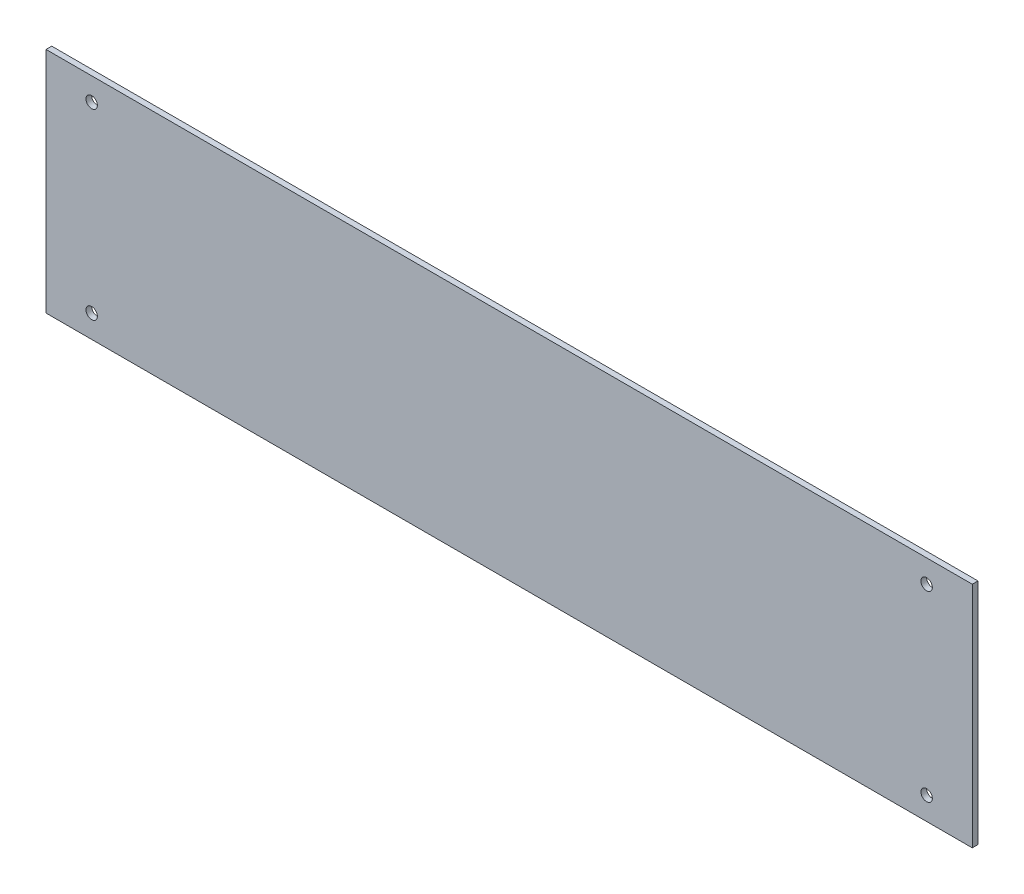
ISO-10303-21;
HEADER;
FILE_DESCRIPTION(('STEP AP214'),'2;1');
FILE_NAME('part.step','',(''),(''),'','','');
FILE_SCHEMA(('AUTOMOTIVE_DESIGN { 1 0 10303 214 1 1 1 1 }'));
ENDSEC;
DATA;
#1=APPLICATION_CONTEXT('core data for automotive mechanical design processes');
#2=APPLICATION_PROTOCOL_DEFINITION('international standard','automotive_design',2000,#1);
#3=PRODUCT_CONTEXT('',#1,'mechanical');
#4=PRODUCT('Part','Part','',(#3));
#5=PRODUCT_RELATED_PRODUCT_CATEGORY('part','',(#4));
#6=PRODUCT_DEFINITION_FORMATION('','',#4);
#7=PRODUCT_DEFINITION_CONTEXT('part definition',#1,'design');
#8=PRODUCT_DEFINITION('design','',#6,#7);
#9=PRODUCT_DEFINITION_SHAPE('','',#8);
#10=(LENGTH_UNIT() NAMED_UNIT(*) SI_UNIT(.MILLI.,.METRE.));
#11=(NAMED_UNIT(*) PLANE_ANGLE_UNIT() SI_UNIT($,.RADIAN.));
#12=(NAMED_UNIT(*) SI_UNIT($,.STERADIAN.) SOLID_ANGLE_UNIT());
#13=UNCERTAINTY_MEASURE_WITH_UNIT(LENGTH_MEASURE(1.E-05),#10,'distance_accuracy_value','');
#14=(GEOMETRIC_REPRESENTATION_CONTEXT(3) GLOBAL_UNCERTAINTY_ASSIGNED_CONTEXT((#13)) GLOBAL_UNIT_ASSIGNED_CONTEXT((#10,
#11,#12)) REPRESENTATION_CONTEXT('',''));
#15=CARTESIAN_POINT('',(0.,0.,0.));
#16=DIRECTION('',(0.,0.,1.));
#17=DIRECTION('',(1.,0.,0.));
#18=AXIS2_PLACEMENT_3D('',#15,#16,#17);
#19=CARTESIAN_POINT('',(0.,0.,3.175));
#20=DIRECTION('',(0.,0.,-1.));
#21=DIRECTION('',(-1.,0.,0.));
#22=AXIS2_PLACEMENT_3D('',#19,#20,#21);
#23=PLANE('',#22);
#24=DIRECTION('',(0.,1.,0.));
#25=VECTOR('',#24,1.);
#26=CARTESIAN_POINT('',(257.60299,-63.5,3.175));
#27=LINE('',#26,#25);
#28=CARTESIAN_POINT('',(257.60299,-63.5,3.175));
#29=VERTEX_POINT('',#28);
#30=CARTESIAN_POINT('',(257.60299,63.5,3.175));
#31=VERTEX_POINT('',#30);
#32=EDGE_CURVE('E92',#29,#31,#27,.T.);
#33=ORIENTED_EDGE('',*,*,#32,.T.);
#34=DIRECTION('',(-1.,0.,0.));
#35=VECTOR('',#34,1.);
#36=CARTESIAN_POINT('',(-257.60299,63.5,3.175));
#37=LINE('',#36,#35);
#38=CARTESIAN_POINT('',(-257.60299,63.5,3.175));
#39=VERTEX_POINT('',#38);
#40=EDGE_CURVE('E87',#31,#39,#37,.T.);
#41=ORIENTED_EDGE('',*,*,#40,.T.);
#42=DIRECTION('',(0.,-1.,0.));
#43=VECTOR('',#42,1.);
#44=CARTESIAN_POINT('',(-257.60299,-63.5,3.175));
#45=LINE('',#44,#43);
#46=CARTESIAN_POINT('',(-257.60299,-63.5,3.175));
#47=VERTEX_POINT('',#46);
#48=EDGE_CURVE('E90',#39,#47,#45,.T.);
#49=ORIENTED_EDGE('',*,*,#48,.T.);
#50=DIRECTION('',(1.,0.,0.));
#51=VECTOR('',#50,1.);
#52=CARTESIAN_POINT('',(-257.60299,-63.5,3.175));
#53=LINE('',#52,#51);
#54=EDGE_CURVE('E57',#47,#29,#53,.T.);
#55=ORIENTED_EDGE('',*,*,#54,.T.);
#56=EDGE_LOOP('',(#33,#41,#49,#55));
#57=FACE_BOUND('',#56,.T.);
#58=CARTESIAN_POINT('',(-232.20299,-50.8,3.175));
#59=DIRECTION('',(0.,0.,1.));
#60=DIRECTION('',(1.,0.,0.));
#61=AXIS2_PLACEMENT_3D('',#58,#59,#60);
#62=CIRCLE('',#61,3.175);
#63=CARTESIAN_POINT('',(-229.02799,-50.8,3.175));
#64=VERTEX_POINT('',#63);
#65=EDGE_CURVE('E112',#64,#64,#62,.T.);
#66=ORIENTED_EDGE('',*,*,#65,.F.);
#67=EDGE_LOOP('',(#66));
#68=FACE_BOUND('',#67,.T.);
#69=CARTESIAN_POINT('',(-232.20299,50.8,3.175));
#70=DIRECTION('',(0.,0.,1.));
#71=DIRECTION('',(1.,0.,0.));
#72=AXIS2_PLACEMENT_3D('',#69,#70,#71);
#73=CIRCLE('',#72,3.175);
#74=CARTESIAN_POINT('',(-229.02799,50.8,3.175));
#75=VERTEX_POINT('',#74);
#76=EDGE_CURVE('E134',#75,#75,#73,.T.);
#77=ORIENTED_EDGE('',*,*,#76,.F.);
#78=EDGE_LOOP('',(#77));
#79=FACE_BOUND('',#78,.T.);
#80=CARTESIAN_POINT('',(232.20299,-50.8,3.175));
#81=DIRECTION('',(0.,0.,1.));
#82=DIRECTION('',(1.,0.,0.));
#83=AXIS2_PLACEMENT_3D('',#80,#81,#82);
#84=CIRCLE('',#83,3.175);
#85=CARTESIAN_POINT('',(235.37799,-50.8,3.175));
#86=VERTEX_POINT('',#85);
#87=EDGE_CURVE('E142',#86,#86,#84,.T.);
#88=ORIENTED_EDGE('',*,*,#87,.F.);
#89=EDGE_LOOP('',(#88));
#90=FACE_BOUND('',#89,.T.);
#91=CARTESIAN_POINT('',(232.20299,50.8,3.175));
#92=DIRECTION('',(0.,0.,1.));
#93=DIRECTION('',(1.,0.,0.));
#94=AXIS2_PLACEMENT_3D('',#91,#92,#93);
#95=CIRCLE('',#94,3.175);
#96=CARTESIAN_POINT('',(235.37799,50.8,3.175));
#97=VERTEX_POINT('',#96);
#98=EDGE_CURVE('E150',#97,#97,#95,.T.);
#99=ORIENTED_EDGE('',*,*,#98,.F.);
#100=EDGE_LOOP('',(#99));
#101=FACE_BOUND('',#100,.T.);
#102=ADVANCED_FACE('F39',(#57,#68,#79,#90,#101),#23,.F.);
#103=CARTESIAN_POINT('',(0.,0.,0.));
#104=DIRECTION('',(0.,0.,-1.));
#105=DIRECTION('',(-1.,0.,0.));
#106=AXIS2_PLACEMENT_3D('',#103,#104,#105);
#107=PLANE('',#106);
#108=CARTESIAN_POINT('',(232.20299,-50.8,0.));
#109=DIRECTION('',(0.,0.,1.));
#110=DIRECTION('',(1.,0.,0.));
#111=AXIS2_PLACEMENT_3D('',#108,#109,#110);
#112=CIRCLE('',#111,3.175);
#113=CARTESIAN_POINT('',(235.37799,-50.8,0.));
#114=VERTEX_POINT('',#113);
#115=EDGE_CURVE('E146',#114,#114,#112,.T.);
#116=ORIENTED_EDGE('',*,*,#115,.T.);
#117=EDGE_LOOP('',(#116));
#118=FACE_BOUND('',#117,.T.);
#119=CARTESIAN_POINT('',(-232.20299,-50.8,0.));
#120=DIRECTION('',(0.,0.,1.));
#121=DIRECTION('',(1.,0.,0.));
#122=AXIS2_PLACEMENT_3D('',#119,#120,#121);
#123=CIRCLE('',#122,3.175);
#124=CARTESIAN_POINT('',(-229.02799,-50.8,0.));
#125=VERTEX_POINT('',#124);
#126=EDGE_CURVE('E130',#125,#125,#123,.T.);
#127=ORIENTED_EDGE('',*,*,#126,.T.);
#128=EDGE_LOOP('',(#127));
#129=FACE_BOUND('',#128,.T.);
#130=DIRECTION('',(0.,1.,0.));
#131=VECTOR('',#130,1.);
#132=CARTESIAN_POINT('',(257.60299,-63.5,0.));
#133=LINE('',#132,#131);
#134=CARTESIAN_POINT('',(257.60299,-63.5,0.));
#135=VERTEX_POINT('',#134);
#136=CARTESIAN_POINT('',(257.60299,63.5,0.));
#137=VERTEX_POINT('',#136);
#138=EDGE_CURVE('E108',#135,#137,#133,.T.);
#139=ORIENTED_EDGE('',*,*,#138,.F.);
#140=DIRECTION('',(1.,0.,0.));
#141=VECTOR('',#140,1.);
#142=CARTESIAN_POINT('',(-257.60299,-63.5,0.));
#143=LINE('',#142,#141);
#144=CARTESIAN_POINT('',(-257.60299,-63.5,0.));
#145=VERTEX_POINT('',#144);
#146=EDGE_CURVE('E80',#145,#135,#143,.T.);
#147=ORIENTED_EDGE('',*,*,#146,.F.);
#148=DIRECTION('',(0.,-1.,0.));
#149=VECTOR('',#148,1.);
#150=CARTESIAN_POINT('',(-257.60299,-63.5,0.));
#151=LINE('',#150,#149);
#152=CARTESIAN_POINT('',(-257.60299,63.5,0.));
#153=VERTEX_POINT('',#152);
#154=EDGE_CURVE('E74',#153,#145,#151,.T.);
#155=ORIENTED_EDGE('',*,*,#154,.F.);
#156=DIRECTION('',(-1.,0.,0.));
#157=VECTOR('',#156,1.);
#158=CARTESIAN_POINT('',(-257.60299,63.5,0.));
#159=LINE('',#158,#157);
#160=EDGE_CURVE('E97',#137,#153,#159,.T.);
#161=ORIENTED_EDGE('',*,*,#160,.F.);
#162=EDGE_LOOP('',(#139,#147,#155,#161));
#163=FACE_BOUND('',#162,.T.);
#164=CARTESIAN_POINT('',(-232.20299,50.8,0.));
#165=DIRECTION('',(0.,0.,1.));
#166=DIRECTION('',(1.,0.,0.));
#167=AXIS2_PLACEMENT_3D('',#164,#165,#166);
#168=CIRCLE('',#167,3.175);
#169=CARTESIAN_POINT('',(-229.02799,50.8,0.));
#170=VERTEX_POINT('',#169);
#171=EDGE_CURVE('E138',#170,#170,#168,.T.);
#172=ORIENTED_EDGE('',*,*,#171,.T.);
#173=EDGE_LOOP('',(#172));
#174=FACE_BOUND('',#173,.T.);
#175=CARTESIAN_POINT('',(232.20299,50.8,0.));
#176=DIRECTION('',(0.,0.,1.));
#177=DIRECTION('',(1.,0.,0.));
#178=AXIS2_PLACEMENT_3D('',#175,#176,#177);
#179=CIRCLE('',#178,3.175);
#180=CARTESIAN_POINT('',(235.37799,50.8,0.));
#181=VERTEX_POINT('',#180);
#182=EDGE_CURVE('E154',#181,#181,#179,.T.);
#183=ORIENTED_EDGE('',*,*,#182,.T.);
#184=EDGE_LOOP('',(#183));
#185=FACE_BOUND('',#184,.T.);
#186=ADVANCED_FACE('F125',(#118,#129,#163,#174,#185),#107,.T.);
#187=CARTESIAN_POINT('',(257.60299,-63.5,3.175));
#188=DIRECTION('',(-1.,0.,0.));
#189=DIRECTION('',(0.,0.,1.));
#190=AXIS2_PLACEMENT_3D('',#187,#188,#189);
#191=PLANE('',#190);
#192=ORIENTED_EDGE('',*,*,#138,.T.);
#193=DIRECTION('',(0.,0.,-1.));
#194=VECTOR('',#193,1.);
#195=CARTESIAN_POINT('',(257.60299,63.5,3.175));
#196=LINE('',#195,#194);
#197=EDGE_CURVE('E11',#31,#137,#196,.T.);
#198=ORIENTED_EDGE('',*,*,#197,.F.);
#199=ORIENTED_EDGE('',*,*,#32,.F.);
#200=DIRECTION('',(0.,0.,-1.));
#201=VECTOR('',#200,1.);
#202=CARTESIAN_POINT('',(257.60299,-63.5,3.175));
#203=LINE('',#202,#201);
#204=EDGE_CURVE('E104',#29,#135,#203,.T.);
#205=ORIENTED_EDGE('',*,*,#204,.T.);
#206=EDGE_LOOP('',(#192,#198,#199,#205));
#207=FACE_BOUND('',#206,.T.);
#208=ADVANCED_FACE('F41',(#207),#191,.F.);
#209=CARTESIAN_POINT('',(-257.60299,63.5,3.175));
#210=DIRECTION('',(0.,-1.,0.));
#211=DIRECTION('',(0.,0.,-1.));
#212=AXIS2_PLACEMENT_3D('',#209,#210,#211);
#213=PLANE('',#212);
#214=ORIENTED_EDGE('',*,*,#160,.T.);
#215=DIRECTION('',(0.,0.,-1.));
#216=VECTOR('',#215,1.);
#217=CARTESIAN_POINT('',(-257.60299,63.5,3.175));
#218=LINE('',#217,#216);
#219=EDGE_CURVE('E49',#39,#153,#218,.T.);
#220=ORIENTED_EDGE('',*,*,#219,.F.);
#221=ORIENTED_EDGE('',*,*,#40,.F.);
#222=ORIENTED_EDGE('',*,*,#197,.T.);
#223=EDGE_LOOP('',(#214,#220,#221,#222));
#224=FACE_BOUND('',#223,.T.);
#225=ADVANCED_FACE('F96',(#224),#213,.F.);
#226=CARTESIAN_POINT('',(-257.60299,-63.5,3.175));
#227=DIRECTION('',(1.,0.,0.));
#228=DIRECTION('',(0.,0.,-1.));
#229=AXIS2_PLACEMENT_3D('',#226,#227,#228);
#230=PLANE('',#229);
#231=ORIENTED_EDGE('',*,*,#154,.T.);
#232=DIRECTION('',(0.,0.,-1.));
#233=VECTOR('',#232,1.);
#234=CARTESIAN_POINT('',(-257.60299,-63.5,3.175));
#235=LINE('',#234,#233);
#236=EDGE_CURVE('E99',#47,#145,#235,.T.);
#237=ORIENTED_EDGE('',*,*,#236,.F.);
#238=ORIENTED_EDGE('',*,*,#48,.F.);
#239=ORIENTED_EDGE('',*,*,#219,.T.);
#240=EDGE_LOOP('',(#231,#237,#238,#239));
#241=FACE_BOUND('',#240,.T.);
#242=ADVANCED_FACE('F100',(#241),#230,.F.);
#243=CARTESIAN_POINT('',(-257.60299,-63.5,3.175));
#244=DIRECTION('',(0.,1.,0.));
#245=DIRECTION('',(0.,0.,1.));
#246=AXIS2_PLACEMENT_3D('',#243,#244,#245);
#247=PLANE('',#246);
#248=ORIENTED_EDGE('',*,*,#146,.T.);
#249=ORIENTED_EDGE('',*,*,#204,.F.);
#250=ORIENTED_EDGE('',*,*,#54,.F.);
#251=ORIENTED_EDGE('',*,*,#236,.T.);
#252=EDGE_LOOP('',(#248,#249,#250,#251));
#253=FACE_BOUND('',#252,.T.);
#254=ADVANCED_FACE('F122',(#253),#247,.F.);
#255=CARTESIAN_POINT('',(-232.20299,-50.8,3.175));
#256=DIRECTION('',(0.,0.,-1.));
#257=DIRECTION('',(-1.,0.,0.));
#258=AXIS2_PLACEMENT_3D('',#255,#256,#257);
#259=CYLINDRICAL_SURFACE('',#258,3.175);
#260=ORIENTED_EDGE('',*,*,#65,.T.);
#261=EDGE_LOOP('',(#260));
#262=FACE_BOUND('',#261,.T.);
#263=ORIENTED_EDGE('',*,*,#126,.F.);
#264=EDGE_LOOP('',(#263));
#265=FACE_BOUND('',#264,.T.);
#266=ADVANCED_FACE('F173',(#262,#265),#259,.F.);
#267=CARTESIAN_POINT('',(-232.20299,50.8,3.175));
#268=DIRECTION('',(0.,0.,-1.));
#269=DIRECTION('',(-1.,0.,0.));
#270=AXIS2_PLACEMENT_3D('',#267,#268,#269);
#271=CYLINDRICAL_SURFACE('',#270,3.175);
#272=ORIENTED_EDGE('',*,*,#76,.T.);
#273=EDGE_LOOP('',(#272));
#274=FACE_BOUND('',#273,.T.);
#275=ORIENTED_EDGE('',*,*,#171,.F.);
#276=EDGE_LOOP('',(#275));
#277=FACE_BOUND('',#276,.T.);
#278=ADVANCED_FACE('F219',(#274,#277),#271,.F.);
#279=CARTESIAN_POINT('',(232.20299,-50.8,3.175));
#280=DIRECTION('',(0.,0.,-1.));
#281=DIRECTION('',(-1.,0.,0.));
#282=AXIS2_PLACEMENT_3D('',#279,#280,#281);
#283=CYLINDRICAL_SURFACE('',#282,3.175);
#284=ORIENTED_EDGE('',*,*,#87,.T.);
#285=EDGE_LOOP('',(#284));
#286=FACE_BOUND('',#285,.T.);
#287=ORIENTED_EDGE('',*,*,#115,.F.);
#288=EDGE_LOOP('',(#287));
#289=FACE_BOUND('',#288,.T.);
#290=ADVANCED_FACE('F227',(#286,#289),#283,.F.);
#291=CARTESIAN_POINT('',(232.20299,50.8,3.175));
#292=DIRECTION('',(0.,0.,-1.));
#293=DIRECTION('',(-1.,0.,0.));
#294=AXIS2_PLACEMENT_3D('',#291,#292,#293);
#295=CYLINDRICAL_SURFACE('',#294,3.175);
#296=ORIENTED_EDGE('',*,*,#98,.T.);
#297=EDGE_LOOP('',(#296));
#298=FACE_BOUND('',#297,.T.);
#299=ORIENTED_EDGE('',*,*,#182,.F.);
#300=EDGE_LOOP('',(#299));
#301=FACE_BOUND('',#300,.T.);
#302=ADVANCED_FACE('F162',(#298,#301),#295,.F.);
#303=CLOSED_SHELL('',(#102,#186,#208,#225,#242,#254,#266,#278,#290,#302));
#304=MANIFOLD_SOLID_BREP('B2',#303);
#305=ADVANCED_BREP_SHAPE_REPRESENTATION('',(#18,#304),#14);
#306=SHAPE_DEFINITION_REPRESENTATION(#9,#305);
ENDSEC;
END-ISO-10303-21;
